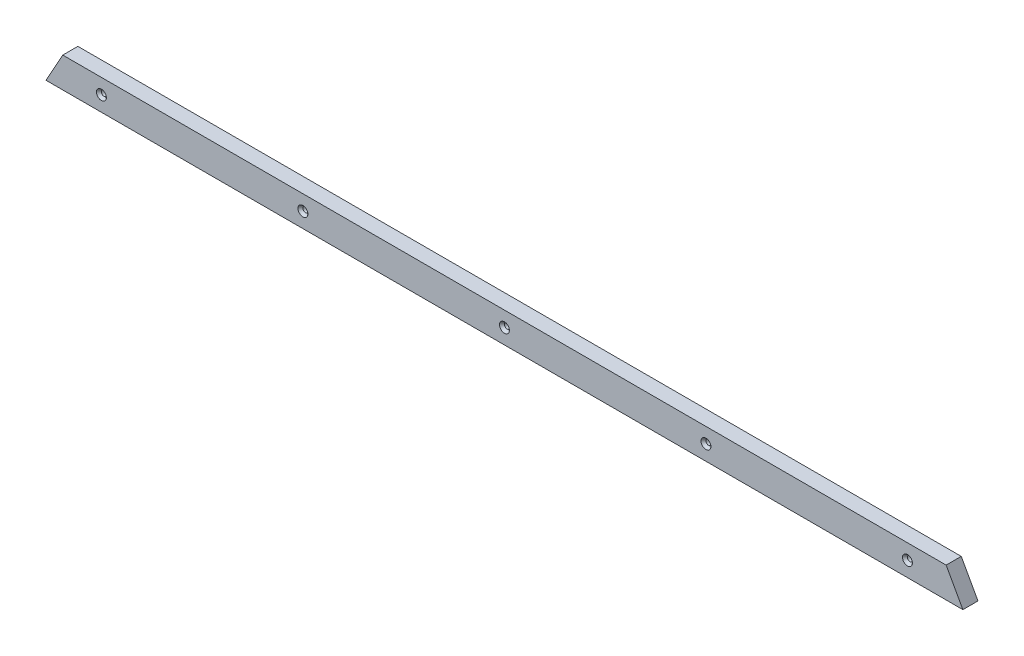
ISO-10303-21;
HEADER;
FILE_DESCRIPTION(('STEP AP214'),'2;1');
FILE_NAME('part.step','',(''),(''),'','','');
FILE_SCHEMA(('AUTOMOTIVE_DESIGN { 1 0 10303 214 1 1 1 1 }'));
ENDSEC;
DATA;
#1=APPLICATION_CONTEXT('core data for automotive mechanical design processes');
#2=APPLICATION_PROTOCOL_DEFINITION('international standard','automotive_design',2000,#1);
#3=PRODUCT_CONTEXT('',#1,'mechanical');
#4=PRODUCT('Part','Part','',(#3));
#5=PRODUCT_RELATED_PRODUCT_CATEGORY('part','',(#4));
#6=PRODUCT_DEFINITION_FORMATION('','',#4);
#7=PRODUCT_DEFINITION_CONTEXT('part definition',#1,'design');
#8=PRODUCT_DEFINITION('design','',#6,#7);
#9=PRODUCT_DEFINITION_SHAPE('','',#8);
#10=(LENGTH_UNIT() NAMED_UNIT(*) SI_UNIT(.MILLI.,.METRE.));
#11=(NAMED_UNIT(*) PLANE_ANGLE_UNIT() SI_UNIT($,.RADIAN.));
#12=(NAMED_UNIT(*) SI_UNIT($,.STERADIAN.) SOLID_ANGLE_UNIT());
#13=UNCERTAINTY_MEASURE_WITH_UNIT(LENGTH_MEASURE(1.E-05),#10,'distance_accuracy_value','');
#14=(GEOMETRIC_REPRESENTATION_CONTEXT(3) GLOBAL_UNCERTAINTY_ASSIGNED_CONTEXT((#13)) GLOBAL_UNIT_ASSIGNED_CONTEXT((#10,
#11,#12)) REPRESENTATION_CONTEXT('',''));
#15=CARTESIAN_POINT('',(0.,0.,0.));
#16=DIRECTION('',(0.,0.,1.));
#17=DIRECTION('',(1.,0.,0.));
#18=AXIS2_PLACEMENT_3D('',#15,#16,#17);
#19=CARTESIAN_POINT('',(0.,0.,19.05));
#20=DIRECTION('',(0.,0.,1.));
#21=DIRECTION('',(1.,0.,0.));
#22=AXIS2_PLACEMENT_3D('',#19,#20,#21);
#23=PLANE('',#22);
#24=CARTESIAN_POINT('',(508.,19.05,19.0499999999361));
#25=DIRECTION('',(0.,0.,1.));
#26=DIRECTION('',(1.,0.,0.));
#27=AXIS2_PLACEMENT_3D('',#24,#25,#26);
#28=CIRCLE('',#27,6.2484000000004);
#29=CARTESIAN_POINT('',(514.2484,19.05,19.0499999999361));
#30=VERTEX_POINT('',#29);
#31=EDGE_CURVE('E75',#30,#30,#28,.F.);
#32=ORIENTED_EDGE('',*,*,#31,.T.);
#33=EDGE_LOOP('',(#32));
#34=FACE_BOUND('',#33,.T.);
#35=CARTESIAN_POINT('',(254.,19.05,19.0499999999361));
#36=DIRECTION('',(0.,0.,1.));
#37=DIRECTION('',(1.,0.,0.));
#38=AXIS2_PLACEMENT_3D('',#35,#36,#37);
#39=CIRCLE('',#38,6.2484000000195);
#40=CARTESIAN_POINT('',(260.24840000002,19.05,19.0499999999361));
#41=VERTEX_POINT('',#40);
#42=EDGE_CURVE('E113',#41,#41,#39,.F.);
#43=ORIENTED_EDGE('',*,*,#42,.T.);
#44=EDGE_LOOP('',(#43));
#45=FACE_BOUND('',#44,.T.);
#46=CARTESIAN_POINT('',(-508.,19.05,19.0499999999361));
#47=DIRECTION('',(0.,0.,1.));
#48=DIRECTION('',(1.,0.,0.));
#49=AXIS2_PLACEMENT_3D('',#46,#47,#48);
#50=CIRCLE('',#49,6.24840000001994);
#51=CARTESIAN_POINT('',(-501.75159999998,19.05,19.0499999999361));
#52=VERTEX_POINT('',#51);
#53=EDGE_CURVE('E116',#52,#52,#50,.F.);
#54=ORIENTED_EDGE('',*,*,#53,.T.);
#55=EDGE_LOOP('',(#54));
#56=FACE_BOUND('',#55,.T.);
#57=CARTESIAN_POINT('',(-254.,19.05,19.0499999999361));
#58=DIRECTION('',(0.,0.,1.));
#59=DIRECTION('',(1.,0.,0.));
#60=AXIS2_PLACEMENT_3D('',#57,#58,#59);
#61=CIRCLE('',#60,6.24840000000084);
#62=CARTESIAN_POINT('',(-247.751599999999,19.05,19.0499999999361));
#63=VERTEX_POINT('',#62);
#64=EDGE_CURVE('E118',#63,#63,#61,.F.);
#65=ORIENTED_EDGE('',*,*,#64,.T.);
#66=EDGE_LOOP('',(#65));
#67=FACE_BOUND('',#66,.T.);
#68=CARTESIAN_POINT('',(0.,19.05,19.0499999999929));
#69=DIRECTION('',(0.,0.,1.));
#70=DIRECTION('',(1.,0.,0.));
#71=AXIS2_PLACEMENT_3D('',#68,#69,#70);
#72=CIRCLE('',#71,6.24839999998918);
#73=CARTESIAN_POINT('',(6.24839999998918,19.05,19.0499999999929));
#74=VERTEX_POINT('',#73);
#75=EDGE_CURVE('E20',#74,#74,#72,.F.);
#76=ORIENTED_EDGE('',*,*,#75,.T.);
#77=EDGE_LOOP('',(#76));
#78=FACE_BOUND('',#77,.T.);
#79=DIRECTION('',(-0.484809620246307,-0.874619707139413,0.));
#80=VECTOR('',#79,1.);
#81=CARTESIAN_POINT('',(-556.730825139628,38.1,19.05));
#82=LINE('',#81,#80);
#83=CARTESIAN_POINT('',(-577.849999999996,-2.45289899503121E-12,19.05));
#84=VERTEX_POINT('',#83);
#85=CARTESIAN_POINT('',(-556.730825139628,38.1,19.05));
#86=VERTEX_POINT('',#85);
#87=EDGE_CURVE('E71',#84,#86,#82,.F.);
#88=ORIENTED_EDGE('',*,*,#87,.F.);
#89=DIRECTION('',(1.,0.,0.));
#90=VECTOR('',#89,1.);
#91=CARTESIAN_POINT('',(-577.85,0.,19.05));
#92=LINE('',#91,#90);
#93=CARTESIAN_POINT('',(577.85,0.,19.05));
#94=VERTEX_POINT('',#93);
#95=EDGE_CURVE('E68',#94,#84,#92,.F.);
#96=ORIENTED_EDGE('',*,*,#95,.F.);
#97=DIRECTION('',(-0.484809620246307,0.874619707139413,0.));
#98=VECTOR('',#97,1.);
#99=CARTESIAN_POINT('',(577.85,0.,19.05));
#100=LINE('',#99,#98);
#101=CARTESIAN_POINT('',(556.730825139632,38.1000000000025,19.05));
#102=VERTEX_POINT('',#101);
#103=EDGE_CURVE('E59',#102,#94,#100,.F.);
#104=ORIENTED_EDGE('',*,*,#103,.F.);
#105=DIRECTION('',(1.,0.,0.));
#106=VECTOR('',#105,1.);
#107=CARTESIAN_POINT('',(556.730825139628,38.1,19.05));
#108=LINE('',#107,#106);
#109=EDGE_CURVE('E54',#86,#102,#108,.T.);
#110=ORIENTED_EDGE('',*,*,#109,.F.);
#111=EDGE_LOOP('',(#88,#96,#104,#110));
#112=FACE_BOUND('',#111,.T.);
#113=ADVANCED_FACE('F17',(#34,#45,#56,#67,#78,#112),#23,.T.);
#114=CARTESIAN_POINT('',(0.,19.05,19.0499999998792));
#115=DIRECTION('',(0.,0.,1.));
#116=DIRECTION('',(1.,0.,0.));
#117=AXIS2_PLACEMENT_3D('',#114,#115,#116);
#118=CONICAL_SURFACE('',#117,6.24839999989035,0.71558499331528);
#119=CARTESIAN_POINT('',(0.,19.05,15.7336029188222));
#120=DIRECTION('',(0.,0.,1.));
#121=DIRECTION('',(1.,0.,0.));
#122=AXIS2_PLACEMENT_3D('',#119,#120,#121);
#123=CIRCLE('',#122,3.3655);
#124=CARTESIAN_POINT('',(3.3655,19.05,15.7336029188222));
#125=VERTEX_POINT('',#124);
#126=EDGE_CURVE('E96',#125,#125,#123,.F.);
#127=ORIENTED_EDGE('',*,*,#126,.T.);
#128=EDGE_LOOP('',(#127));
#129=FACE_BOUND('',#128,.T.);
#130=ORIENTED_EDGE('',*,*,#75,.F.);
#131=EDGE_LOOP('',(#130));
#132=FACE_BOUND('',#131,.T.);
#133=ADVANCED_FACE('F126',(#129,#132),#118,.F.);
#134=CARTESIAN_POINT('',(-254.,19.05,19.0499999997655));
#135=DIRECTION('',(0.,0.,1.));
#136=DIRECTION('',(1.,0.,0.));
#137=AXIS2_PLACEMENT_3D('',#134,#135,#136);
#138=CONICAL_SURFACE('',#137,6.24839999985261,0.715584993314004);
#139=CARTESIAN_POINT('',(-254.,19.05,15.7336029188222));
#140=DIRECTION('',(0.,0.,1.));
#141=DIRECTION('',(1.,0.,0.));
#142=AXIS2_PLACEMENT_3D('',#139,#140,#141);
#143=CIRCLE('',#142,3.3655);
#144=CARTESIAN_POINT('',(-250.6345,19.05,15.7336029188222));
#145=VERTEX_POINT('',#144);
#146=EDGE_CURVE('E93',#145,#145,#143,.F.);
#147=ORIENTED_EDGE('',*,*,#146,.T.);
#148=EDGE_LOOP('',(#147));
#149=FACE_BOUND('',#148,.T.);
#150=ORIENTED_EDGE('',*,*,#64,.F.);
#151=EDGE_LOOP('',(#150));
#152=FACE_BOUND('',#151,.T.);
#153=ADVANCED_FACE('F128',(#149,#152),#138,.F.);
#154=CARTESIAN_POINT('',(-508.,19.05,19.0499999997655));
#155=DIRECTION('',(0.,0.,1.));
#156=DIRECTION('',(1.,0.,0.));
#157=AXIS2_PLACEMENT_3D('',#154,#155,#156);
#158=CONICAL_SURFACE('',#157,6.2483999998717,0.715584993314004);
#159=CARTESIAN_POINT('',(-508.,19.05,15.7336029188222));
#160=DIRECTION('',(0.,0.,1.));
#161=DIRECTION('',(1.,0.,0.));
#162=AXIS2_PLACEMENT_3D('',#159,#160,#161);
#163=CIRCLE('',#162,3.3655);
#164=CARTESIAN_POINT('',(-504.6345,19.05,15.7336029188222));
#165=VERTEX_POINT('',#164);
#166=EDGE_CURVE('E90',#165,#165,#163,.F.);
#167=ORIENTED_EDGE('',*,*,#166,.T.);
#168=EDGE_LOOP('',(#167));
#169=FACE_BOUND('',#168,.T.);
#170=ORIENTED_EDGE('',*,*,#53,.F.);
#171=EDGE_LOOP('',(#170));
#172=FACE_BOUND('',#171,.T.);
#173=ADVANCED_FACE('F135',(#169,#172),#158,.F.);
#174=CARTESIAN_POINT('',(254.,19.05,19.0499999997655));
#175=DIRECTION('',(0.,0.,1.));
#176=DIRECTION('',(1.,0.,0.));
#177=AXIS2_PLACEMENT_3D('',#174,#175,#176);
#178=CONICAL_SURFACE('',#177,6.24839999987126,0.715584993319108);
#179=CARTESIAN_POINT('',(254.,19.05,15.7336029188222));
#180=DIRECTION('',(0.,0.,1.));
#181=DIRECTION('',(1.,0.,0.));
#182=AXIS2_PLACEMENT_3D('',#179,#180,#181);
#183=CIRCLE('',#182,3.3655);
#184=CARTESIAN_POINT('',(257.3655,19.05,15.7336029188222));
#185=VERTEX_POINT('',#184);
#186=EDGE_CURVE('E87',#185,#185,#183,.F.);
#187=ORIENTED_EDGE('',*,*,#186,.T.);
#188=EDGE_LOOP('',(#187));
#189=FACE_BOUND('',#188,.T.);
#190=ORIENTED_EDGE('',*,*,#42,.F.);
#191=EDGE_LOOP('',(#190));
#192=FACE_BOUND('',#191,.T.);
#193=ADVANCED_FACE('F181',(#189,#192),#178,.F.);
#194=CARTESIAN_POINT('',(508.,19.05,19.0499999997655));
#195=DIRECTION('',(0.,0.,1.));
#196=DIRECTION('',(1.,0.,0.));
#197=AXIS2_PLACEMENT_3D('',#194,#195,#196);
#198=CONICAL_SURFACE('',#197,6.24839999985216,0.715584993314004);
#199=CARTESIAN_POINT('',(508.,19.05,15.7336029188222));
#200=DIRECTION('',(0.,0.,1.));
#201=DIRECTION('',(1.,0.,0.));
#202=AXIS2_PLACEMENT_3D('',#199,#200,#201);
#203=CIRCLE('',#202,3.3655);
#204=CARTESIAN_POINT('',(511.3655,19.05,15.7336029188222));
#205=VERTEX_POINT('',#204);
#206=EDGE_CURVE('E84',#205,#205,#203,.F.);
#207=ORIENTED_EDGE('',*,*,#206,.T.);
#208=EDGE_LOOP('',(#207));
#209=FACE_BOUND('',#208,.T.);
#210=ORIENTED_EDGE('',*,*,#31,.F.);
#211=EDGE_LOOP('',(#210));
#212=FACE_BOUND('',#211,.T.);
#213=ADVANCED_FACE('F178',(#209,#212),#198,.F.);
#214=CARTESIAN_POINT('',(-577.85,0.,0.));
#215=DIRECTION('',(0.,-1.,0.));
#216=DIRECTION('',(0.,0.,-1.));
#217=AXIS2_PLACEMENT_3D('',#214,#215,#216);
#218=PLANE('',#217);
#219=DIRECTION('',(0.,0.,1.));
#220=VECTOR('',#219,1.);
#221=CARTESIAN_POINT('',(-577.849999999982,-9.81853487402873E-12,0.));
#222=LINE('',#221,#220);
#223=CARTESIAN_POINT('',(-577.849999999996,-2.45897052719712E-12,0.));
#224=VERTEX_POINT('',#223);
#225=EDGE_CURVE('E213',#224,#84,#222,.T.);
#226=ORIENTED_EDGE('',*,*,#225,.F.);
#227=DIRECTION('',(1.,0.,0.));
#228=VECTOR('',#227,1.);
#229=CARTESIAN_POINT('',(0.,0.,0.));
#230=LINE('',#229,#228);
#231=CARTESIAN_POINT('',(577.85,0.,0.));
#232=VERTEX_POINT('',#231);
#233=EDGE_CURVE('E79',#224,#232,#230,.T.);
#234=ORIENTED_EDGE('',*,*,#233,.T.);
#235=DIRECTION('',(0.,0.,1.));
#236=VECTOR('',#235,1.);
#237=CARTESIAN_POINT('',(577.85,0.,0.));
#238=LINE('',#237,#236);
#239=EDGE_CURVE('E64',#94,#232,#238,.F.);
#240=ORIENTED_EDGE('',*,*,#239,.F.);
#241=ORIENTED_EDGE('',*,*,#95,.T.);
#242=EDGE_LOOP('',(#226,#234,#240,#241));
#243=FACE_BOUND('',#242,.T.);
#244=ADVANCED_FACE('F78',(#243),#218,.T.);
#245=CARTESIAN_POINT('',(577.85,0.,0.));
#246=DIRECTION('',(0.874619707139413,0.484809620246307,0.));
#247=DIRECTION('',(-0.484809620246307,0.874619707139413,0.));
#248=AXIS2_PLACEMENT_3D('',#245,#246,#247);
#249=PLANE('',#248);
#250=ORIENTED_EDGE('',*,*,#239,.T.);
#251=DIRECTION('',(-0.484809620246714,0.874619707139187,0.));
#252=VECTOR('',#251,1.);
#253=CARTESIAN_POINT('',(577.85,0.,0.));
#254=LINE('',#253,#252);
#255=CARTESIAN_POINT('',(556.730825139637,38.1000000000049,0.));
#256=VERTEX_POINT('',#255);
#257=EDGE_CURVE('E205',#232,#256,#254,.T.);
#258=ORIENTED_EDGE('',*,*,#257,.T.);
#259=DIRECTION('',(0.,0.,1.));
#260=VECTOR('',#259,1.);
#261=CARTESIAN_POINT('',(556.730825139628,38.1,0.));
#262=LINE('',#261,#260);
#263=EDGE_CURVE('E66',#102,#256,#262,.F.);
#264=ORIENTED_EDGE('',*,*,#263,.F.);
#265=ORIENTED_EDGE('',*,*,#103,.T.);
#266=EDGE_LOOP('',(#250,#258,#264,#265));
#267=FACE_BOUND('',#266,.T.);
#268=ADVANCED_FACE('F61',(#267),#249,.T.);
#269=CARTESIAN_POINT('',(556.730825139628,38.1,0.));
#270=DIRECTION('',(0.,1.,0.));
#271=DIRECTION('',(0.,0.,1.));
#272=AXIS2_PLACEMENT_3D('',#269,#270,#271);
#273=PLANE('',#272);
#274=ORIENTED_EDGE('',*,*,#263,.T.);
#275=DIRECTION('',(1.,0.,0.));
#276=VECTOR('',#275,1.);
#277=CARTESIAN_POINT('',(0.,38.1,0.));
#278=LINE('',#277,#276);
#279=CARTESIAN_POINT('',(-556.730825139628,38.1,0.));
#280=VERTEX_POINT('',#279);
#281=EDGE_CURVE('E204',#256,#280,#278,.F.);
#282=ORIENTED_EDGE('',*,*,#281,.T.);
#283=DIRECTION('',(0.,0.,1.));
#284=VECTOR('',#283,1.);
#285=CARTESIAN_POINT('',(-556.730825139628,38.1,0.));
#286=LINE('',#285,#284);
#287=EDGE_CURVE('E35',#86,#280,#286,.F.);
#288=ORIENTED_EDGE('',*,*,#287,.F.);
#289=ORIENTED_EDGE('',*,*,#109,.T.);
#290=EDGE_LOOP('',(#274,#282,#288,#289));
#291=FACE_BOUND('',#290,.T.);
#292=ADVANCED_FACE('F171',(#291),#273,.T.);
#293=CARTESIAN_POINT('',(-556.730825139628,38.1,0.));
#294=DIRECTION('',(-0.874619707139413,0.484809620246307,0.));
#295=DIRECTION('',(-0.484809620246307,-0.874619707139413,0.));
#296=AXIS2_PLACEMENT_3D('',#293,#294,#295);
#297=PLANE('',#296);
#298=ORIENTED_EDGE('',*,*,#287,.T.);
#299=DIRECTION('',(-0.484809620246714,-0.874619707139187,0.));
#300=VECTOR('',#299,1.);
#301=CARTESIAN_POINT('',(-556.730825139628,38.1,0.));
#302=LINE('',#301,#300);
#303=EDGE_CURVE('E110',#280,#224,#302,.T.);
#304=ORIENTED_EDGE('',*,*,#303,.T.);
#305=ORIENTED_EDGE('',*,*,#225,.T.);
#306=ORIENTED_EDGE('',*,*,#87,.T.);
#307=EDGE_LOOP('',(#298,#304,#305,#306));
#308=FACE_BOUND('',#307,.T.);
#309=ADVANCED_FACE('F167',(#308),#297,.T.);
#310=CARTESIAN_POINT('',(0.,19.05,-2.95275));
#311=DIRECTION('',(0.,0.,1.));
#312=DIRECTION('',(1.,0.,0.));
#313=AXIS2_PLACEMENT_3D('',#310,#311,#312);
#314=CYLINDRICAL_SURFACE('',#313,3.3655);
#315=ORIENTED_EDGE('',*,*,#126,.F.);
#316=EDGE_LOOP('',(#315));
#317=FACE_BOUND('',#316,.T.);
#318=CARTESIAN_POINT('',(0.,19.05,0.));
#319=DIRECTION('',(0.,0.,1.));
#320=DIRECTION('',(1.,0.,0.));
#321=AXIS2_PLACEMENT_3D('',#318,#319,#320);
#322=CIRCLE('',#321,3.3655);
#323=CARTESIAN_POINT('',(3.3655,19.05,0.));
#324=VERTEX_POINT('',#323);
#325=EDGE_CURVE('E107',#324,#324,#322,.F.);
#326=ORIENTED_EDGE('',*,*,#325,.T.);
#327=EDGE_LOOP('',(#326));
#328=FACE_BOUND('',#327,.T.);
#329=ADVANCED_FACE('F163',(#317,#328),#314,.F.);
#330=CARTESIAN_POINT('',(-254.,19.05,-2.95275));
#331=DIRECTION('',(0.,0.,1.));
#332=DIRECTION('',(1.,0.,0.));
#333=AXIS2_PLACEMENT_3D('',#330,#331,#332);
#334=CYLINDRICAL_SURFACE('',#333,3.3655);
#335=ORIENTED_EDGE('',*,*,#146,.F.);
#336=EDGE_LOOP('',(#335));
#337=FACE_BOUND('',#336,.T.);
#338=CARTESIAN_POINT('',(-254.,19.05,0.));
#339=DIRECTION('',(0.,0.,1.));
#340=DIRECTION('',(1.,0.,0.));
#341=AXIS2_PLACEMENT_3D('',#338,#339,#340);
#342=CIRCLE('',#341,3.3655);
#343=CARTESIAN_POINT('',(-250.6345,19.05,0.));
#344=VERTEX_POINT('',#343);
#345=EDGE_CURVE('E104',#344,#344,#342,.F.);
#346=ORIENTED_EDGE('',*,*,#345,.T.);
#347=EDGE_LOOP('',(#346));
#348=FACE_BOUND('',#347,.T.);
#349=ADVANCED_FACE('F159',(#337,#348),#334,.F.);
#350=CARTESIAN_POINT('',(-508.,19.05,-2.95275));
#351=DIRECTION('',(0.,0.,1.));
#352=DIRECTION('',(1.,0.,0.));
#353=AXIS2_PLACEMENT_3D('',#350,#351,#352);
#354=CYLINDRICAL_SURFACE('',#353,3.3655);
#355=ORIENTED_EDGE('',*,*,#166,.F.);
#356=EDGE_LOOP('',(#355));
#357=FACE_BOUND('',#356,.T.);
#358=CARTESIAN_POINT('',(-508.,19.05,0.));
#359=DIRECTION('',(0.,0.,1.));
#360=DIRECTION('',(1.,0.,0.));
#361=AXIS2_PLACEMENT_3D('',#358,#359,#360);
#362=CIRCLE('',#361,3.3655);
#363=CARTESIAN_POINT('',(-504.6345,19.05,0.));
#364=VERTEX_POINT('',#363);
#365=EDGE_CURVE('E101',#364,#364,#362,.F.);
#366=ORIENTED_EDGE('',*,*,#365,.T.);
#367=EDGE_LOOP('',(#366));
#368=FACE_BOUND('',#367,.T.);
#369=ADVANCED_FACE('F155',(#357,#368),#354,.F.);
#370=CARTESIAN_POINT('',(254.,19.05,-2.95275));
#371=DIRECTION('',(0.,0.,1.));
#372=DIRECTION('',(1.,0.,0.));
#373=AXIS2_PLACEMENT_3D('',#370,#371,#372);
#374=CYLINDRICAL_SURFACE('',#373,3.3655);
#375=ORIENTED_EDGE('',*,*,#186,.F.);
#376=EDGE_LOOP('',(#375));
#377=FACE_BOUND('',#376,.T.);
#378=CARTESIAN_POINT('',(254.,19.05,0.));
#379=DIRECTION('',(0.,0.,1.));
#380=DIRECTION('',(1.,0.,0.));
#381=AXIS2_PLACEMENT_3D('',#378,#379,#380);
#382=CIRCLE('',#381,3.3655);
#383=CARTESIAN_POINT('',(257.3655,19.05,0.));
#384=VERTEX_POINT('',#383);
#385=EDGE_CURVE('E26',#384,#384,#382,.F.);
#386=ORIENTED_EDGE('',*,*,#385,.T.);
#387=EDGE_LOOP('',(#386));
#388=FACE_BOUND('',#387,.T.);
#389=ADVANCED_FACE('F147',(#377,#388),#374,.F.);
#390=CARTESIAN_POINT('',(508.,19.05,-2.95275));
#391=DIRECTION('',(0.,0.,1.));
#392=DIRECTION('',(1.,0.,0.));
#393=AXIS2_PLACEMENT_3D('',#390,#391,#392);
#394=CYLINDRICAL_SURFACE('',#393,3.3655);
#395=ORIENTED_EDGE('',*,*,#206,.F.);
#396=EDGE_LOOP('',(#395));
#397=FACE_BOUND('',#396,.T.);
#398=CARTESIAN_POINT('',(508.,19.05,0.));
#399=DIRECTION('',(0.,0.,1.));
#400=DIRECTION('',(1.,0.,0.));
#401=AXIS2_PLACEMENT_3D('',#398,#399,#400);
#402=CIRCLE('',#401,3.3655);
#403=CARTESIAN_POINT('',(511.3655,19.05,0.));
#404=VERTEX_POINT('',#403);
#405=EDGE_CURVE('E11',#404,#404,#402,.F.);
#406=ORIENTED_EDGE('',*,*,#405,.T.);
#407=EDGE_LOOP('',(#406));
#408=FACE_BOUND('',#407,.T.);
#409=ADVANCED_FACE('F141',(#397,#408),#394,.F.);
#410=CARTESIAN_POINT('',(0.,0.,0.));
#411=DIRECTION('',(0.,0.,1.));
#412=DIRECTION('',(1.,0.,0.));
#413=AXIS2_PLACEMENT_3D('',#410,#411,#412);
#414=PLANE('',#413);
#415=ORIENTED_EDGE('',*,*,#405,.F.);
#416=EDGE_LOOP('',(#415));
#417=FACE_BOUND('',#416,.T.);
#418=ORIENTED_EDGE('',*,*,#385,.F.);
#419=EDGE_LOOP('',(#418));
#420=FACE_BOUND('',#419,.T.);
#421=ORIENTED_EDGE('',*,*,#365,.F.);
#422=EDGE_LOOP('',(#421));
#423=FACE_BOUND('',#422,.T.);
#424=ORIENTED_EDGE('',*,*,#345,.F.);
#425=EDGE_LOOP('',(#424));
#426=FACE_BOUND('',#425,.T.);
#427=ORIENTED_EDGE('',*,*,#325,.F.);
#428=EDGE_LOOP('',(#427));
#429=FACE_BOUND('',#428,.T.);
#430=ORIENTED_EDGE('',*,*,#281,.F.);
#431=ORIENTED_EDGE('',*,*,#257,.F.);
#432=ORIENTED_EDGE('',*,*,#233,.F.);
#433=ORIENTED_EDGE('',*,*,#303,.F.);
#434=EDGE_LOOP('',(#430,#431,#432,#433));
#435=FACE_BOUND('',#434,.T.);
#436=ADVANCED_FACE('F139',(#417,#420,#423,#426,#429,#435),#414,.F.);
#437=CLOSED_SHELL('',(#113,#133,#153,#173,#193,#213,#244,#268,#292,#309,#329,#349,#369,#389,
#409,#436));
#438=MANIFOLD_SOLID_BREP('B1',#437);
#439=ADVANCED_BREP_SHAPE_REPRESENTATION('',(#18,#438),#14);
#440=SHAPE_DEFINITION_REPRESENTATION(#9,#439);
ENDSEC;
END-ISO-10303-21;
